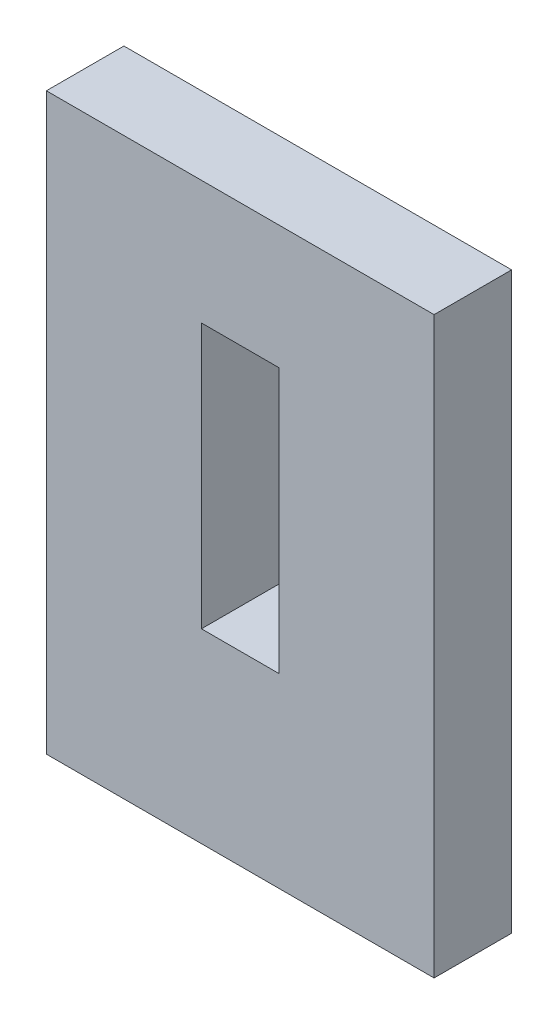
ISO-10303-21;
HEADER;
FILE_DESCRIPTION(('STEP AP214'),'2;1');
FILE_NAME('part.step','',(''),(''),'','','');
FILE_SCHEMA(('AUTOMOTIVE_DESIGN { 1 0 10303 214 1 1 1 1 }'));
ENDSEC;
DATA;
#1=APPLICATION_CONTEXT('core data for automotive mechanical design processes');
#2=APPLICATION_PROTOCOL_DEFINITION('international standard','automotive_design',2000,#1);
#3=PRODUCT_CONTEXT('',#1,'mechanical');
#4=PRODUCT('Part','Part','',(#3));
#5=PRODUCT_RELATED_PRODUCT_CATEGORY('part','',(#4));
#6=PRODUCT_DEFINITION_FORMATION('','',#4);
#7=PRODUCT_DEFINITION_CONTEXT('part definition',#1,'design');
#8=PRODUCT_DEFINITION('design','',#6,#7);
#9=PRODUCT_DEFINITION_SHAPE('','',#8);
#10=(LENGTH_UNIT() NAMED_UNIT(*) SI_UNIT(.MILLI.,.METRE.));
#11=(NAMED_UNIT(*) PLANE_ANGLE_UNIT() SI_UNIT($,.RADIAN.));
#12=(NAMED_UNIT(*) SI_UNIT($,.STERADIAN.) SOLID_ANGLE_UNIT());
#13=UNCERTAINTY_MEASURE_WITH_UNIT(LENGTH_MEASURE(1.E-05),#10,'distance_accuracy_value','');
#14=(GEOMETRIC_REPRESENTATION_CONTEXT(3) GLOBAL_UNCERTAINTY_ASSIGNED_CONTEXT((#13)) GLOBAL_UNIT_ASSIGNED_CONTEXT((#10,
#11,#12)) REPRESENTATION_CONTEXT('',''));
#15=CARTESIAN_POINT('',(0.,0.,0.));
#16=DIRECTION('',(0.,0.,1.));
#17=DIRECTION('',(1.,0.,0.));
#18=AXIS2_PLACEMENT_3D('',#15,#16,#17);
#19=CARTESIAN_POINT('',(0.,0.,6.35));
#20=DIRECTION('',(0.,0.,-1.));
#21=DIRECTION('',(-1.,0.,0.));
#22=AXIS2_PLACEMENT_3D('',#19,#20,#21);
#23=PLANE('',#22);
#24=DIRECTION('',(0.,-1.,0.));
#25=VECTOR('',#24,1.);
#26=CARTESIAN_POINT('',(0.,0.,6.35));
#27=LINE('',#26,#25);
#28=CARTESIAN_POINT('',(0.,47.0473216216216,6.35));
#29=VERTEX_POINT('',#28);
#30=CARTESIAN_POINT('',(0.,0.,6.35));
#31=VERTEX_POINT('',#30);
#32=EDGE_CURVE('E157',#29,#31,#27,.T.);
#33=ORIENTED_EDGE('',*,*,#32,.T.);
#34=DIRECTION('',(1.,0.,0.));
#35=VECTOR('',#34,1.);
#36=CARTESIAN_POINT('',(0.,0.,6.35));
#37=LINE('',#36,#35);
#38=CARTESIAN_POINT('',(31.75,0.,6.35));
#39=VERTEX_POINT('',#38);
#40=EDGE_CURVE('E161',#31,#39,#37,.T.);
#41=ORIENTED_EDGE('',*,*,#40,.T.);
#42=DIRECTION('',(0.,1.,0.));
#43=VECTOR('',#42,1.);
#44=CARTESIAN_POINT('',(31.75,0.,6.35));
#45=LINE('',#44,#43);
#46=CARTESIAN_POINT('',(31.75,47.0473216216216,6.35));
#47=VERTEX_POINT('',#46);
#48=EDGE_CURVE('E165',#39,#47,#45,.T.);
#49=ORIENTED_EDGE('',*,*,#48,.T.);
#50=DIRECTION('',(-1.,0.,0.));
#51=VECTOR('',#50,1.);
#52=CARTESIAN_POINT('',(0.,47.0473216216216,6.35));
#53=LINE('',#52,#51);
#54=EDGE_CURVE('E168',#47,#29,#53,.T.);
#55=ORIENTED_EDGE('',*,*,#54,.T.);
#56=EDGE_LOOP('',(#33,#41,#49,#55));
#57=FACE_BOUND('',#56,.T.);
#58=DIRECTION('',(0.,-1.,0.));
#59=VECTOR('',#58,1.);
#60=CARTESIAN_POINT('',(12.7,15.24,6.35));
#61=LINE('',#60,#59);
#62=CARTESIAN_POINT('',(12.7,36.9316,6.35));
#63=VERTEX_POINT('',#62);
#64=CARTESIAN_POINT('',(12.7,15.24,6.35));
#65=VERTEX_POINT('',#64);
#66=EDGE_CURVE('E109',#63,#65,#61,.T.);
#67=ORIENTED_EDGE('',*,*,#66,.F.);
#68=DIRECTION('',(-1.,0.,0.));
#69=VECTOR('',#68,1.);
#70=CARTESIAN_POINT('',(12.7,36.9316,6.35));
#71=LINE('',#70,#69);
#72=CARTESIAN_POINT('',(19.05,36.9316,6.35));
#73=VERTEX_POINT('',#72);
#74=EDGE_CURVE('E135',#73,#63,#71,.T.);
#75=ORIENTED_EDGE('',*,*,#74,.F.);
#76=DIRECTION('',(0.,1.,0.));
#77=VECTOR('',#76,1.);
#78=CARTESIAN_POINT('',(19.05,15.24,6.35));
#79=LINE('',#78,#77);
#80=CARTESIAN_POINT('',(19.05,15.24,6.35));
#81=VERTEX_POINT('',#80);
#82=EDGE_CURVE('E131',#81,#73,#79,.T.);
#83=ORIENTED_EDGE('',*,*,#82,.F.);
#84=DIRECTION('',(1.,0.,0.));
#85=VECTOR('',#84,1.);
#86=CARTESIAN_POINT('',(12.7,15.24,6.35));
#87=LINE('',#86,#85);
#88=EDGE_CURVE('E118',#65,#81,#87,.T.);
#89=ORIENTED_EDGE('',*,*,#88,.F.);
#90=EDGE_LOOP('',(#67,#75,#83,#89));
#91=FACE_BOUND('',#90,.T.);
#92=ADVANCED_FACE('F43',(#57,#91),#23,.F.);
#93=CARTESIAN_POINT('',(0.,0.,0.));
#94=DIRECTION('',(0.,0.,-1.));
#95=DIRECTION('',(-1.,0.,0.));
#96=AXIS2_PLACEMENT_3D('',#93,#94,#95);
#97=PLANE('',#96);
#98=DIRECTION('',(0.,-1.,0.));
#99=VECTOR('',#98,1.);
#100=CARTESIAN_POINT('',(0.,0.,0.));
#101=LINE('',#100,#99);
#102=CARTESIAN_POINT('',(0.,47.0473216216216,0.));
#103=VERTEX_POINT('',#102);
#104=CARTESIAN_POINT('',(0.,0.,0.));
#105=VERTEX_POINT('',#104);
#106=EDGE_CURVE('E127',#103,#105,#101,.T.);
#107=ORIENTED_EDGE('',*,*,#106,.F.);
#108=DIRECTION('',(-1.,0.,0.));
#109=VECTOR('',#108,1.);
#110=CARTESIAN_POINT('',(0.,47.0473216216216,0.));
#111=LINE('',#110,#109);
#112=CARTESIAN_POINT('',(31.75,47.0473216216216,0.));
#113=VERTEX_POINT('',#112);
#114=EDGE_CURVE('E162',#113,#103,#111,.T.);
#115=ORIENTED_EDGE('',*,*,#114,.F.);
#116=DIRECTION('',(0.,1.,0.));
#117=VECTOR('',#116,1.);
#118=CARTESIAN_POINT('',(31.75,0.,0.));
#119=LINE('',#118,#117);
#120=CARTESIAN_POINT('',(31.75,0.,0.));
#121=VERTEX_POINT('',#120);
#122=EDGE_CURVE('E178',#121,#113,#119,.T.);
#123=ORIENTED_EDGE('',*,*,#122,.F.);
#124=DIRECTION('',(1.,0.,0.));
#125=VECTOR('',#124,1.);
#126=CARTESIAN_POINT('',(0.,0.,0.));
#127=LINE('',#126,#125);
#128=EDGE_CURVE('E175',#105,#121,#127,.T.);
#129=ORIENTED_EDGE('',*,*,#128,.F.);
#130=EDGE_LOOP('',(#107,#115,#123,#129));
#131=FACE_BOUND('',#130,.T.);
#132=DIRECTION('',(-1.,0.,0.));
#133=VECTOR('',#132,1.);
#134=CARTESIAN_POINT('',(12.7,36.9316,0.));
#135=LINE('',#134,#133);
#136=CARTESIAN_POINT('',(19.05,36.9316,0.));
#137=VERTEX_POINT('',#136);
#138=CARTESIAN_POINT('',(12.7,36.9316,0.));
#139=VERTEX_POINT('',#138);
#140=EDGE_CURVE('E119',#137,#139,#135,.T.);
#141=ORIENTED_EDGE('',*,*,#140,.T.);
#142=DIRECTION('',(0.,-1.,0.));
#143=VECTOR('',#142,1.);
#144=CARTESIAN_POINT('',(12.7,15.24,0.));
#145=LINE('',#144,#143);
#146=CARTESIAN_POINT('',(12.7,15.24,0.));
#147=VERTEX_POINT('',#146);
#148=EDGE_CURVE('E67',#139,#147,#145,.T.);
#149=ORIENTED_EDGE('',*,*,#148,.T.);
#150=DIRECTION('',(1.,0.,0.));
#151=VECTOR('',#150,1.);
#152=CARTESIAN_POINT('',(12.7,15.24,0.));
#153=LINE('',#152,#151);
#154=CARTESIAN_POINT('',(19.05,15.24,0.));
#155=VERTEX_POINT('',#154);
#156=EDGE_CURVE('E125',#147,#155,#153,.T.);
#157=ORIENTED_EDGE('',*,*,#156,.T.);
#158=DIRECTION('',(0.,1.,0.));
#159=VECTOR('',#158,1.);
#160=CARTESIAN_POINT('',(19.05,15.24,0.));
#161=LINE('',#160,#159);
#162=EDGE_CURVE('E144',#155,#137,#161,.T.);
#163=ORIENTED_EDGE('',*,*,#162,.T.);
#164=EDGE_LOOP('',(#141,#149,#157,#163));
#165=FACE_BOUND('',#164,.T.);
#166=ADVANCED_FACE('F201',(#131,#165),#97,.T.);
#167=CARTESIAN_POINT('',(0.,0.,6.35));
#168=DIRECTION('',(1.,0.,0.));
#169=DIRECTION('',(0.,0.,-1.));
#170=AXIS2_PLACEMENT_3D('',#167,#168,#169);
#171=PLANE('',#170);
#172=ORIENTED_EDGE('',*,*,#106,.T.);
#173=DIRECTION('',(0.,0.,-1.));
#174=VECTOR('',#173,1.);
#175=CARTESIAN_POINT('',(0.,0.,6.35));
#176=LINE('',#175,#174);
#177=EDGE_CURVE('E11',#31,#105,#176,.T.);
#178=ORIENTED_EDGE('',*,*,#177,.F.);
#179=ORIENTED_EDGE('',*,*,#32,.F.);
#180=DIRECTION('',(0.,0.,-1.));
#181=VECTOR('',#180,1.);
#182=CARTESIAN_POINT('',(0.,47.0473216216216,6.35));
#183=LINE('',#182,#181);
#184=EDGE_CURVE('E171',#29,#103,#183,.T.);
#185=ORIENTED_EDGE('',*,*,#184,.T.);
#186=EDGE_LOOP('',(#172,#178,#179,#185));
#187=FACE_BOUND('',#186,.T.);
#188=ADVANCED_FACE('F45',(#187),#171,.F.);
#189=CARTESIAN_POINT('',(0.,0.,6.35));
#190=DIRECTION('',(0.,1.,0.));
#191=DIRECTION('',(0.,0.,1.));
#192=AXIS2_PLACEMENT_3D('',#189,#190,#191);
#193=PLANE('',#192);
#194=ORIENTED_EDGE('',*,*,#128,.T.);
#195=DIRECTION('',(0.,0.,-1.));
#196=VECTOR('',#195,1.);
#197=CARTESIAN_POINT('',(31.75,0.,6.35));
#198=LINE('',#197,#196);
#199=EDGE_CURVE('E52',#39,#121,#198,.T.);
#200=ORIENTED_EDGE('',*,*,#199,.F.);
#201=ORIENTED_EDGE('',*,*,#40,.F.);
#202=ORIENTED_EDGE('',*,*,#177,.T.);
#203=EDGE_LOOP('',(#194,#200,#201,#202));
#204=FACE_BOUND('',#203,.T.);
#205=ADVANCED_FACE('F211',(#204),#193,.F.);
#206=CARTESIAN_POINT('',(31.75,0.,6.35));
#207=DIRECTION('',(-1.,0.,0.));
#208=DIRECTION('',(0.,0.,1.));
#209=AXIS2_PLACEMENT_3D('',#206,#207,#208);
#210=PLANE('',#209);
#211=ORIENTED_EDGE('',*,*,#122,.T.);
#212=DIRECTION('',(0.,0.,-1.));
#213=VECTOR('',#212,1.);
#214=CARTESIAN_POINT('',(31.75,47.0473216216216,6.35));
#215=LINE('',#214,#213);
#216=EDGE_CURVE('E186',#47,#113,#215,.T.);
#217=ORIENTED_EDGE('',*,*,#216,.F.);
#218=ORIENTED_EDGE('',*,*,#48,.F.);
#219=ORIENTED_EDGE('',*,*,#199,.T.);
#220=EDGE_LOOP('',(#211,#217,#218,#219));
#221=FACE_BOUND('',#220,.T.);
#222=ADVANCED_FACE('F195',(#221),#210,.F.);
#223=CARTESIAN_POINT('',(0.,47.0473216216216,6.35));
#224=DIRECTION('',(0.,-1.,0.));
#225=DIRECTION('',(0.,0.,-1.));
#226=AXIS2_PLACEMENT_3D('',#223,#224,#225);
#227=PLANE('',#226);
#228=ORIENTED_EDGE('',*,*,#114,.T.);
#229=ORIENTED_EDGE('',*,*,#184,.F.);
#230=ORIENTED_EDGE('',*,*,#54,.F.);
#231=ORIENTED_EDGE('',*,*,#216,.T.);
#232=EDGE_LOOP('',(#228,#229,#230,#231));
#233=FACE_BOUND('',#232,.T.);
#234=ADVANCED_FACE('F205',(#233),#227,.F.);
#235=CARTESIAN_POINT('',(12.7,15.24,6.35));
#236=DIRECTION('',(1.,0.,0.));
#237=DIRECTION('',(0.,0.,-1.));
#238=AXIS2_PLACEMENT_3D('',#235,#236,#237);
#239=PLANE('',#238);
#240=ORIENTED_EDGE('',*,*,#148,.F.);
#241=DIRECTION('',(0.,0.,-1.));
#242=VECTOR('',#241,1.);
#243=CARTESIAN_POINT('',(12.7,36.9316,6.35));
#244=LINE('',#243,#242);
#245=EDGE_CURVE('E113',#63,#139,#244,.T.);
#246=ORIENTED_EDGE('',*,*,#245,.F.);
#247=ORIENTED_EDGE('',*,*,#66,.T.);
#248=DIRECTION('',(0.,0.,-1.));
#249=VECTOR('',#248,1.);
#250=CARTESIAN_POINT('',(12.7,15.24,6.35));
#251=LINE('',#250,#249);
#252=EDGE_CURVE('E112',#65,#147,#251,.T.);
#253=ORIENTED_EDGE('',*,*,#252,.T.);
#254=EDGE_LOOP('',(#240,#246,#247,#253));
#255=FACE_BOUND('',#254,.T.);
#256=ADVANCED_FACE('F111',(#255),#239,.T.);
#257=CARTESIAN_POINT('',(12.7,15.24,6.35));
#258=DIRECTION('',(0.,1.,0.));
#259=DIRECTION('',(0.,0.,1.));
#260=AXIS2_PLACEMENT_3D('',#257,#258,#259);
#261=PLANE('',#260);
#262=ORIENTED_EDGE('',*,*,#156,.F.);
#263=ORIENTED_EDGE('',*,*,#252,.F.);
#264=ORIENTED_EDGE('',*,*,#88,.T.);
#265=DIRECTION('',(0.,0.,-1.));
#266=VECTOR('',#265,1.);
#267=CARTESIAN_POINT('',(19.05,15.24,6.35));
#268=LINE('',#267,#266);
#269=EDGE_CURVE('E128',#81,#155,#268,.T.);
#270=ORIENTED_EDGE('',*,*,#269,.T.);
#271=EDGE_LOOP('',(#262,#263,#264,#270));
#272=FACE_BOUND('',#271,.T.);
#273=ADVANCED_FACE('F122',(#272),#261,.T.);
#274=CARTESIAN_POINT('',(19.05,15.24,6.35));
#275=DIRECTION('',(-1.,0.,0.));
#276=DIRECTION('',(0.,-1.,0.));
#277=AXIS2_PLACEMENT_3D('',#274,#275,#276);
#278=PLANE('',#277);
#279=ORIENTED_EDGE('',*,*,#162,.F.);
#280=ORIENTED_EDGE('',*,*,#269,.F.);
#281=ORIENTED_EDGE('',*,*,#82,.T.);
#282=DIRECTION('',(0.,0.,-1.));
#283=VECTOR('',#282,1.);
#284=CARTESIAN_POINT('',(19.05,36.9316,6.35));
#285=LINE('',#284,#283);
#286=EDGE_CURVE('E59',#73,#137,#285,.T.);
#287=ORIENTED_EDGE('',*,*,#286,.T.);
#288=EDGE_LOOP('',(#279,#280,#281,#287));
#289=FACE_BOUND('',#288,.T.);
#290=ADVANCED_FACE('F234',(#289),#278,.T.);
#291=CARTESIAN_POINT('',(12.7,36.9316,6.35));
#292=DIRECTION('',(0.,-1.,0.));
#293=DIRECTION('',(0.,0.,-1.));
#294=AXIS2_PLACEMENT_3D('',#291,#292,#293);
#295=PLANE('',#294);
#296=ORIENTED_EDGE('',*,*,#140,.F.);
#297=ORIENTED_EDGE('',*,*,#286,.F.);
#298=ORIENTED_EDGE('',*,*,#74,.T.);
#299=ORIENTED_EDGE('',*,*,#245,.T.);
#300=EDGE_LOOP('',(#296,#297,#298,#299));
#301=FACE_BOUND('',#300,.T.);
#302=ADVANCED_FACE('F238',(#301),#295,.T.);
#303=CLOSED_SHELL('',(#92,#166,#188,#205,#222,#234,#256,#273,#290,#302));
#304=MANIFOLD_SOLID_BREP('B2',#303);
#305=ADVANCED_BREP_SHAPE_REPRESENTATION('',(#18,#304),#14);
#306=SHAPE_DEFINITION_REPRESENTATION(#9,#305);
ENDSEC;
END-ISO-10303-21;
